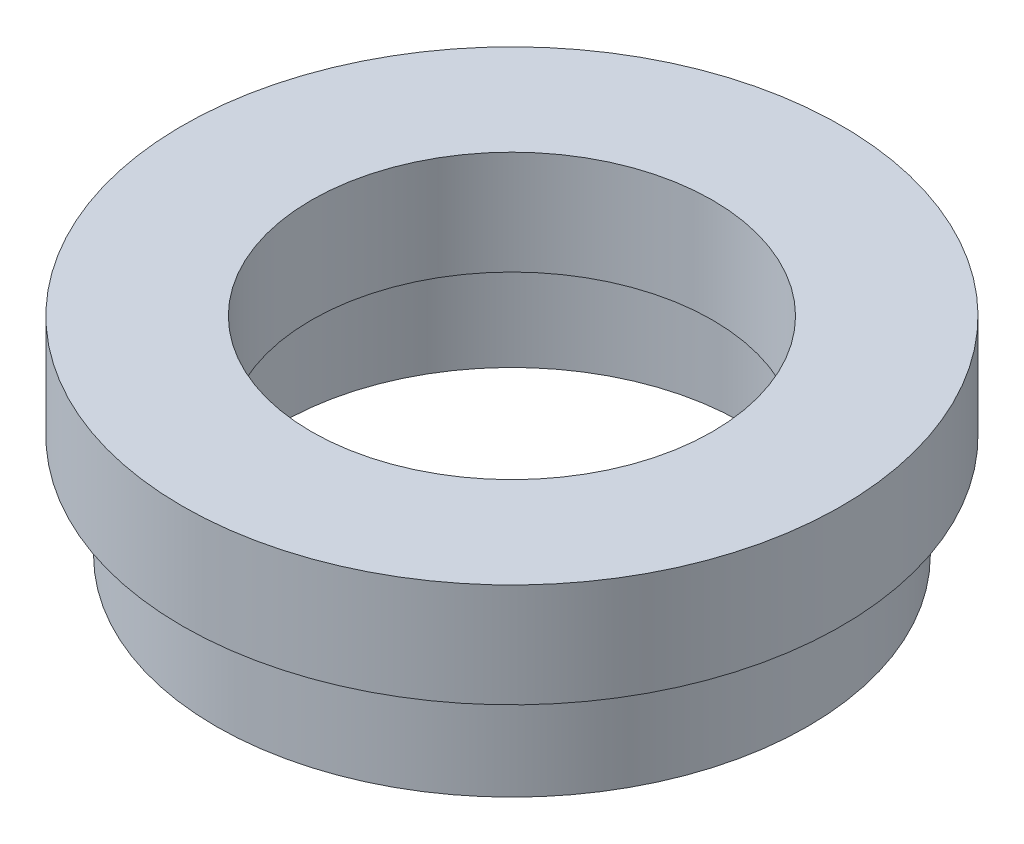
ISO-10303-21;
HEADER;
FILE_DESCRIPTION(('STEP AP214'),'2;1');
FILE_NAME('part.step','',(''),(''),'','','');
FILE_SCHEMA(('AUTOMOTIVE_DESIGN { 1 0 10303 214 1 1 1 1 }'));
ENDSEC;
DATA;
#1=APPLICATION_CONTEXT('core data for automotive mechanical design processes');
#2=APPLICATION_PROTOCOL_DEFINITION('international standard','automotive_design',2000,#1);
#3=PRODUCT_CONTEXT('',#1,'mechanical');
#4=PRODUCT('Part','Part','',(#3));
#5=PRODUCT_RELATED_PRODUCT_CATEGORY('part','',(#4));
#6=PRODUCT_DEFINITION_FORMATION('','',#4);
#7=PRODUCT_DEFINITION_CONTEXT('part definition',#1,'design');
#8=PRODUCT_DEFINITION('design','',#6,#7);
#9=PRODUCT_DEFINITION_SHAPE('','',#8);
#10=(LENGTH_UNIT() NAMED_UNIT(*) SI_UNIT(.MILLI.,.METRE.));
#11=(NAMED_UNIT(*) PLANE_ANGLE_UNIT() SI_UNIT($,.RADIAN.));
#12=(NAMED_UNIT(*) SI_UNIT($,.STERADIAN.) SOLID_ANGLE_UNIT());
#13=UNCERTAINTY_MEASURE_WITH_UNIT(LENGTH_MEASURE(1.E-05),#10,'distance_accuracy_value','');
#14=(GEOMETRIC_REPRESENTATION_CONTEXT(3) GLOBAL_UNCERTAINTY_ASSIGNED_CONTEXT((#13)) GLOBAL_UNIT_ASSIGNED_CONTEXT((#10,
#11,#12)) REPRESENTATION_CONTEXT('',''));
#15=CARTESIAN_POINT('',(0.,0.,0.));
#16=DIRECTION('',(0.,0.,1.));
#17=DIRECTION('',(1.,0.,0.));
#18=AXIS2_PLACEMENT_3D('',#15,#16,#17);
#19=CARTESIAN_POINT('',(0.,13.7446808510638,0.));
#20=DIRECTION('',(0.,1.,0.));
#21=DIRECTION('',(0.,0.,1.));
#22=AXIS2_PLACEMENT_3D('',#19,#20,#21);
#23=CYLINDRICAL_SURFACE('',#22,11.1);
#24=CARTESIAN_POINT('',(0.,0.,0.));
#25=DIRECTION('',(0.,1.,0.));
#26=DIRECTION('',(0.,0.,1.));
#27=AXIS2_PLACEMENT_3D('',#24,#25,#26);
#28=CIRCLE('',#27,11.1);
#29=CARTESIAN_POINT('',(0.,0.,11.1));
#30=VERTEX_POINT('',#29);
#31=EDGE_CURVE('E73',#30,#30,#28,.T.);
#32=ORIENTED_EDGE('',*,*,#31,.F.);
#33=EDGE_LOOP('',(#32));
#34=FACE_BOUND('',#33,.T.);
#35=CARTESIAN_POINT('',(0.,4.,0.));
#36=DIRECTION('',(0.,1.,0.));
#37=DIRECTION('',(0.,0.,1.));
#38=AXIS2_PLACEMENT_3D('',#35,#36,#37);
#39=CIRCLE('',#38,11.1);
#40=CARTESIAN_POINT('',(0.,4.,11.1));
#41=VERTEX_POINT('',#40);
#42=EDGE_CURVE('E10',#41,#41,#39,.T.);
#43=ORIENTED_EDGE('',*,*,#42,.T.);
#44=EDGE_LOOP('',(#43));
#45=FACE_BOUND('',#44,.T.);
#46=ADVANCED_FACE('F33',(#34,#45),#23,.F.);
#47=CARTESIAN_POINT('',(11.1,4.,0.));
#48=DIRECTION('',(0.,-1.,0.));
#49=DIRECTION('',(0.,0.,-1.));
#50=AXIS2_PLACEMENT_3D('',#47,#48,#49);
#51=PLANE('',#50);
#52=ORIENTED_EDGE('',*,*,#42,.F.);
#53=EDGE_LOOP('',(#52));
#54=FACE_BOUND('',#53,.T.);
#55=CARTESIAN_POINT('',(0.,4.,0.));
#56=DIRECTION('',(0.,1.,0.));
#57=DIRECTION('',(0.,0.,1.));
#58=AXIS2_PLACEMENT_3D('',#55,#56,#57);
#59=CIRCLE('',#58,11.7);
#60=CARTESIAN_POINT('',(0.,4.,11.7));
#61=VERTEX_POINT('',#60);
#62=EDGE_CURVE('E39',#61,#61,#59,.T.);
#63=ORIENTED_EDGE('',*,*,#62,.T.);
#64=EDGE_LOOP('',(#63));
#65=FACE_BOUND('',#64,.T.);
#66=ADVANCED_FACE('F80',(#54,#65),#51,.F.);
#67=CARTESIAN_POINT('',(0.,13.7446808510638,0.));
#68=DIRECTION('',(0.,1.,0.));
#69=DIRECTION('',(0.,0.,1.));
#70=AXIS2_PLACEMENT_3D('',#67,#68,#69);
#71=CYLINDRICAL_SURFACE('',#70,11.7);
#72=ORIENTED_EDGE('',*,*,#62,.F.);
#73=EDGE_LOOP('',(#72));
#74=FACE_BOUND('',#73,.T.);
#75=CARTESIAN_POINT('',(0.,5.,0.));
#76=DIRECTION('',(0.,1.,0.));
#77=DIRECTION('',(0.,0.,1.));
#78=AXIS2_PLACEMENT_3D('',#75,#76,#77);
#79=CIRCLE('',#78,11.7);
#80=CARTESIAN_POINT('',(0.,5.,11.7));
#81=VERTEX_POINT('',#80);
#82=EDGE_CURVE('E43',#81,#81,#79,.T.);
#83=ORIENTED_EDGE('',*,*,#82,.T.);
#84=EDGE_LOOP('',(#83));
#85=FACE_BOUND('',#84,.T.);
#86=ADVANCED_FACE('F84',(#74,#85),#71,.F.);
#87=CARTESIAN_POINT('',(11.7,5.,0.));
#88=DIRECTION('',(0.,1.,0.));
#89=DIRECTION('',(0.,0.,1.));
#90=AXIS2_PLACEMENT_3D('',#87,#88,#89);
#91=PLANE('',#90);
#92=ORIENTED_EDGE('',*,*,#82,.F.);
#93=EDGE_LOOP('',(#92));
#94=FACE_BOUND('',#93,.T.);
#95=CARTESIAN_POINT('',(0.,5.,0.));
#96=DIRECTION('',(0.,1.,0.));
#97=DIRECTION('',(0.,0.,1.));
#98=AXIS2_PLACEMENT_3D('',#95,#96,#97);
#99=CIRCLE('',#98,9.66);
#100=CARTESIAN_POINT('',(0.,5.,9.66));
#101=VERTEX_POINT('',#100);
#102=EDGE_CURVE('E47',#101,#101,#99,.T.);
#103=ORIENTED_EDGE('',*,*,#102,.T.);
#104=EDGE_LOOP('',(#103));
#105=FACE_BOUND('',#104,.T.);
#106=ADVANCED_FACE('F89',(#94,#105),#91,.F.);
#107=CARTESIAN_POINT('',(0.,13.7446808510638,0.));
#108=DIRECTION('',(0.,1.,0.));
#109=DIRECTION('',(0.,0.,1.));
#110=AXIS2_PLACEMENT_3D('',#107,#108,#109);
#111=CYLINDRICAL_SURFACE('',#110,9.66);
#112=ORIENTED_EDGE('',*,*,#102,.F.);
#113=EDGE_LOOP('',(#112));
#114=FACE_BOUND('',#113,.T.);
#115=CARTESIAN_POINT('',(0.,10.,0.));
#116=DIRECTION('',(0.,1.,0.));
#117=DIRECTION('',(0.,0.,1.));
#118=AXIS2_PLACEMENT_3D('',#115,#116,#117);
#119=CIRCLE('',#118,9.66);
#120=CARTESIAN_POINT('',(0.,10.,9.66));
#121=VERTEX_POINT('',#120);
#122=EDGE_CURVE('E52',#121,#121,#119,.T.);
#123=ORIENTED_EDGE('',*,*,#122,.T.);
#124=EDGE_LOOP('',(#123));
#125=FACE_BOUND('',#124,.T.);
#126=ADVANCED_FACE('F95',(#114,#125),#111,.F.);
#127=CARTESIAN_POINT('',(9.66,10.,0.));
#128=DIRECTION('',(0.,-1.,0.));
#129=DIRECTION('',(0.,0.,-1.));
#130=AXIS2_PLACEMENT_3D('',#127,#128,#129);
#131=PLANE('',#130);
#132=ORIENTED_EDGE('',*,*,#122,.F.);
#133=EDGE_LOOP('',(#132));
#134=FACE_BOUND('',#133,.T.);
#135=CARTESIAN_POINT('',(0.,10.,0.));
#136=DIRECTION('',(0.,1.,0.));
#137=DIRECTION('',(0.,0.,1.));
#138=AXIS2_PLACEMENT_3D('',#135,#136,#137);
#139=CIRCLE('',#138,15.875);
#140=CARTESIAN_POINT('',(0.,10.,15.875));
#141=VERTEX_POINT('',#140);
#142=EDGE_CURVE('E55',#141,#141,#139,.T.);
#143=ORIENTED_EDGE('',*,*,#142,.T.);
#144=EDGE_LOOP('',(#143));
#145=FACE_BOUND('',#144,.T.);
#146=ADVANCED_FACE('F99',(#134,#145),#131,.F.);
#147=CARTESIAN_POINT('',(0.,13.7446808510638,0.));
#148=DIRECTION('',(0.,1.,0.));
#149=DIRECTION('',(0.,0.,1.));
#150=AXIS2_PLACEMENT_3D('',#147,#148,#149);
#151=CYLINDRICAL_SURFACE('',#150,15.875);
#152=ORIENTED_EDGE('',*,*,#142,.F.);
#153=EDGE_LOOP('',(#152));
#154=FACE_BOUND('',#153,.T.);
#155=CARTESIAN_POINT('',(0.,5.,0.));
#156=DIRECTION('',(0.,1.,0.));
#157=DIRECTION('',(0.,0.,1.));
#158=AXIS2_PLACEMENT_3D('',#155,#156,#157);
#159=CIRCLE('',#158,15.875);
#160=CARTESIAN_POINT('',(0.,5.,15.875));
#161=VERTEX_POINT('',#160);
#162=EDGE_CURVE('E58',#161,#161,#159,.T.);
#163=ORIENTED_EDGE('',*,*,#162,.T.);
#164=EDGE_LOOP('',(#163));
#165=FACE_BOUND('',#164,.T.);
#166=ADVANCED_FACE('F103',(#154,#165),#151,.T.);
#167=CARTESIAN_POINT('',(15.875,5.,0.));
#168=DIRECTION('',(0.,1.,0.));
#169=DIRECTION('',(0.,0.,1.));
#170=AXIS2_PLACEMENT_3D('',#167,#168,#169);
#171=PLANE('',#170);
#172=ORIENTED_EDGE('',*,*,#162,.F.);
#173=EDGE_LOOP('',(#172));
#174=FACE_BOUND('',#173,.T.);
#175=CARTESIAN_POINT('',(0.,5.,0.));
#176=DIRECTION('',(0.,1.,0.));
#177=DIRECTION('',(0.,0.,1.));
#178=AXIS2_PLACEMENT_3D('',#175,#176,#177);
#179=CIRCLE('',#178,13.75);
#180=CARTESIAN_POINT('',(0.,5.,13.75));
#181=VERTEX_POINT('',#180);
#182=EDGE_CURVE('E61',#181,#181,#179,.T.);
#183=ORIENTED_EDGE('',*,*,#182,.T.);
#184=EDGE_LOOP('',(#183));
#185=FACE_BOUND('',#184,.T.);
#186=ADVANCED_FACE('F107',(#174,#185),#171,.F.);
#187=CARTESIAN_POINT('',(0.,13.7446808510638,0.));
#188=DIRECTION('',(0.,1.,0.));
#189=DIRECTION('',(0.,0.,1.));
#190=AXIS2_PLACEMENT_3D('',#187,#188,#189);
#191=CYLINDRICAL_SURFACE('',#190,13.75);
#192=ORIENTED_EDGE('',*,*,#182,.F.);
#193=EDGE_LOOP('',(#192));
#194=FACE_BOUND('',#193,.T.);
#195=CARTESIAN_POINT('',(0.,4.,0.));
#196=DIRECTION('',(0.,1.,0.));
#197=DIRECTION('',(0.,0.,1.));
#198=AXIS2_PLACEMENT_3D('',#195,#196,#197);
#199=CIRCLE('',#198,13.75);
#200=CARTESIAN_POINT('',(0.,4.,13.75));
#201=VERTEX_POINT('',#200);
#202=EDGE_CURVE('E64',#201,#201,#199,.T.);
#203=ORIENTED_EDGE('',*,*,#202,.T.);
#204=EDGE_LOOP('',(#203));
#205=FACE_BOUND('',#204,.T.);
#206=ADVANCED_FACE('F111',(#194,#205),#191,.T.);
#207=CARTESIAN_POINT('',(13.75,4.,0.));
#208=DIRECTION('',(0.,-1.,0.));
#209=DIRECTION('',(0.,0.,-1.));
#210=AXIS2_PLACEMENT_3D('',#207,#208,#209);
#211=PLANE('',#210);
#212=ORIENTED_EDGE('',*,*,#202,.F.);
#213=EDGE_LOOP('',(#212));
#214=FACE_BOUND('',#213,.T.);
#215=CARTESIAN_POINT('',(0.,4.,0.));
#216=DIRECTION('',(0.,1.,0.));
#217=DIRECTION('',(0.,0.,1.));
#218=AXIS2_PLACEMENT_3D('',#215,#216,#217);
#219=CIRCLE('',#218,14.25);
#220=CARTESIAN_POINT('',(0.,4.,14.25));
#221=VERTEX_POINT('',#220);
#222=EDGE_CURVE('E67',#221,#221,#219,.T.);
#223=ORIENTED_EDGE('',*,*,#222,.T.);
#224=EDGE_LOOP('',(#223));
#225=FACE_BOUND('',#224,.T.);
#226=ADVANCED_FACE('F115',(#214,#225),#211,.F.);
#227=CARTESIAN_POINT('',(0.,13.7446808510638,0.));
#228=DIRECTION('',(0.,1.,0.));
#229=DIRECTION('',(0.,0.,1.));
#230=AXIS2_PLACEMENT_3D('',#227,#228,#229);
#231=CYLINDRICAL_SURFACE('',#230,14.25);
#232=ORIENTED_EDGE('',*,*,#222,.F.);
#233=EDGE_LOOP('',(#232));
#234=FACE_BOUND('',#233,.T.);
#235=CARTESIAN_POINT('',(0.,0.,0.));
#236=DIRECTION('',(0.,1.,0.));
#237=DIRECTION('',(0.,0.,1.));
#238=AXIS2_PLACEMENT_3D('',#235,#236,#237);
#239=CIRCLE('',#238,14.25);
#240=CARTESIAN_POINT('',(0.,0.,14.25));
#241=VERTEX_POINT('',#240);
#242=EDGE_CURVE('E70',#241,#241,#239,.T.);
#243=ORIENTED_EDGE('',*,*,#242,.T.);
#244=EDGE_LOOP('',(#243));
#245=FACE_BOUND('',#244,.T.);
#246=ADVANCED_FACE('F119',(#234,#245),#231,.T.);
#247=CARTESIAN_POINT('',(14.25,0.,0.));
#248=DIRECTION('',(0.,1.,0.));
#249=DIRECTION('',(0.,0.,1.));
#250=AXIS2_PLACEMENT_3D('',#247,#248,#249);
#251=PLANE('',#250);
#252=ORIENTED_EDGE('',*,*,#242,.F.);
#253=EDGE_LOOP('',(#252));
#254=FACE_BOUND('',#253,.T.);
#255=ORIENTED_EDGE('',*,*,#31,.T.);
#256=EDGE_LOOP('',(#255));
#257=FACE_BOUND('',#256,.T.);
#258=ADVANCED_FACE('F77',(#254,#257),#251,.F.);
#259=CLOSED_SHELL('',(#46,#66,#86,#106,#126,#146,#166,#186,#206,#226,#246,#258));
#260=MANIFOLD_SOLID_BREP('B2',#259);
#261=ADVANCED_BREP_SHAPE_REPRESENTATION('',(#18,#260),#14);
#262=SHAPE_DEFINITION_REPRESENTATION(#9,#261);
ENDSEC;
END-ISO-10303-21;
